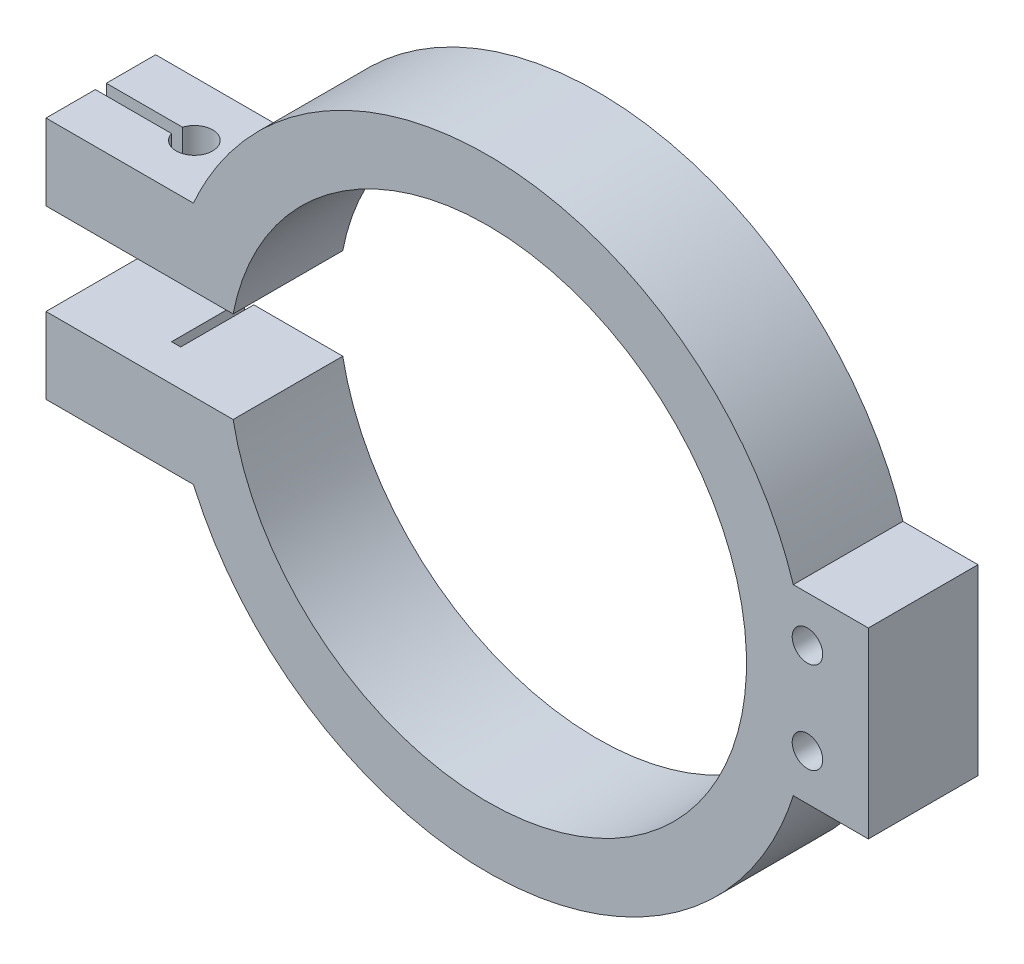
ISO-10303-21;
HEADER;
FILE_DESCRIPTION(('STEP AP214'),'2;1');
FILE_NAME('part.step','',(''),(''),'','','');
FILE_SCHEMA(('AUTOMOTIVE_DESIGN { 1 0 10303 214 1 1 1 1 }'));
ENDSEC;
DATA;
#1=APPLICATION_CONTEXT('core data for automotive mechanical design processes');
#2=APPLICATION_PROTOCOL_DEFINITION('international standard','automotive_design',2000,#1);
#3=PRODUCT_CONTEXT('',#1,'mechanical');
#4=PRODUCT('Part','Part','',(#3));
#5=PRODUCT_RELATED_PRODUCT_CATEGORY('part','',(#4));
#6=PRODUCT_DEFINITION_FORMATION('','',#4);
#7=PRODUCT_DEFINITION_CONTEXT('part definition',#1,'design');
#8=PRODUCT_DEFINITION('design','',#6,#7);
#9=PRODUCT_DEFINITION_SHAPE('','',#8);
#10=(LENGTH_UNIT() NAMED_UNIT(*) SI_UNIT(.MILLI.,.METRE.));
#11=(NAMED_UNIT(*) PLANE_ANGLE_UNIT() SI_UNIT($,.RADIAN.));
#12=(NAMED_UNIT(*) SI_UNIT($,.STERADIAN.) SOLID_ANGLE_UNIT());
#13=UNCERTAINTY_MEASURE_WITH_UNIT(LENGTH_MEASURE(1.E-05),#10,'distance_accuracy_value','');
#14=(GEOMETRIC_REPRESENTATION_CONTEXT(3) GLOBAL_UNCERTAINTY_ASSIGNED_CONTEXT((#13)) GLOBAL_UNIT_ASSIGNED_CONTEXT((#10,
#11,#12)) REPRESENTATION_CONTEXT('',''));
#15=CARTESIAN_POINT('',(0.,0.,0.));
#16=DIRECTION('',(0.,0.,1.));
#17=DIRECTION('',(1.,0.,0.));
#18=AXIS2_PLACEMENT_3D('',#15,#16,#17);
#19=CARTESIAN_POINT('',(-72.5,0.,18.));
#20=DIRECTION('',(1.,0.,0.));
#21=DIRECTION('',(0.,0.,-1.));
#22=AXIS2_PLACEMENT_3D('',#19,#20,#21);
#23=PLANE('',#22);
#24=DIRECTION('',(0.,0.,-1.));
#25=VECTOR('',#24,1.);
#26=CARTESIAN_POINT('',(-72.5,7.5,18.));
#27=LINE('',#26,#25);
#28=CARTESIAN_POINT('',(-72.5,7.5,8.1));
#29=VERTEX_POINT('',#28);
#30=CARTESIAN_POINT('',(-72.5,7.5,0.));
#31=VERTEX_POINT('',#30);
#32=EDGE_CURVE('E351',#29,#31,#27,.T.);
#33=ORIENTED_EDGE('',*,*,#32,.F.);
#34=DIRECTION('',(0.,1.,0.));
#35=VECTOR('',#34,1.);
#36=CARTESIAN_POINT('',(-72.5,14.,8.1));
#37=LINE('',#36,#35);
#38=CARTESIAN_POINT('',(-72.5,20.,8.1));
#39=VERTEX_POINT('',#38);
#40=EDGE_CURVE('E247',#29,#39,#37,.T.);
#41=ORIENTED_EDGE('',*,*,#40,.T.);
#42=DIRECTION('',(0.,0.,-1.));
#43=VECTOR('',#42,1.);
#44=CARTESIAN_POINT('',(-72.5,20.,18.));
#45=LINE('',#44,#43);
#46=CARTESIAN_POINT('',(-72.5,20.,0.));
#47=VERTEX_POINT('',#46);
#48=EDGE_CURVE('E349',#39,#47,#45,.T.);
#49=ORIENTED_EDGE('',*,*,#48,.T.);
#50=DIRECTION('',(0.,-1.,0.));
#51=VECTOR('',#50,1.);
#52=CARTESIAN_POINT('',(-72.5,0.,0.));
#53=LINE('',#52,#51);
#54=EDGE_CURVE('E404',#47,#31,#53,.T.);
#55=ORIENTED_EDGE('',*,*,#54,.T.);
#56=EDGE_LOOP('',(#33,#41,#49,#55));
#57=FACE_BOUND('',#56,.T.);
#58=ADVANCED_FACE('F54',(#57),#23,.F.);
#59=CARTESIAN_POINT('',(0.,7.5,18.));
#60=DIRECTION('',(0.,-1.,0.));
#61=DIRECTION('',(0.,0.,-1.));
#62=AXIS2_PLACEMENT_3D('',#59,#60,#61);
#63=PLANE('',#62);
#64=CARTESIAN_POINT('',(-57.1414387748637,7.5,9.));
#65=DIRECTION('',(0.,-1.,0.));
#66=DIRECTION('',(0.,0.,-1.));
#67=AXIS2_PLACEMENT_3D('',#64,#65,#66);
#68=CIRCLE('',#67,0.999999999999998);
#69=CARTESIAN_POINT('',(-57.5773286692178,7.5,9.9));
#70=VERTEX_POINT('',#69);
#71=CARTESIAN_POINT('',(-57.5773286692178,7.5,8.1));
#72=VERTEX_POINT('',#71);
#73=EDGE_CURVE('E214',#70,#72,#68,.F.);
#74=ORIENTED_EDGE('',*,*,#73,.T.);
#75=DIRECTION('',(1.,0.,0.));
#76=VECTOR('',#75,1.);
#77=CARTESIAN_POINT('',(0.,7.5,8.09999999999997));
#78=LINE('',#77,#76);
#79=EDGE_CURVE('E211',#29,#72,#78,.T.);
#80=ORIENTED_EDGE('',*,*,#79,.F.);
#81=ORIENTED_EDGE('',*,*,#32,.T.);
#82=DIRECTION('',(-1.,0.,0.));
#83=VECTOR('',#82,1.);
#84=CARTESIAN_POINT('',(0.,7.5,0.));
#85=LINE('',#84,#83);
#86=CARTESIAN_POINT('',(-41.7828775497274,7.5,0.));
#87=VERTEX_POINT('',#86);
#88=EDGE_CURVE('E401',#87,#31,#85,.T.);
#89=ORIENTED_EDGE('',*,*,#88,.F.);
#90=DIRECTION('',(0.,0.,-1.));
#91=VECTOR('',#90,1.);
#92=CARTESIAN_POINT('',(-41.7828775497274,7.5,18.));
#93=LINE('',#92,#91);
#94=CARTESIAN_POINT('',(-41.7828775497274,7.5,18.));
#95=VERTEX_POINT('',#94);
#96=EDGE_CURVE('E352',#95,#87,#93,.T.);
#97=ORIENTED_EDGE('',*,*,#96,.F.);
#98=DIRECTION('',(-1.,0.,0.));
#99=VECTOR('',#98,1.);
#100=CARTESIAN_POINT('',(0.,7.5,18.));
#101=LINE('',#100,#99);
#102=CARTESIAN_POINT('',(-72.5,7.5,18.));
#103=VERTEX_POINT('',#102);
#104=EDGE_CURVE('E466',#95,#103,#101,.T.);
#105=ORIENTED_EDGE('',*,*,#104,.T.);
#106=CARTESIAN_POINT('',(-72.5,7.5,9.9));
#107=VERTEX_POINT('',#106);
#108=EDGE_CURVE('E225',#103,#107,#27,.T.);
#109=ORIENTED_EDGE('',*,*,#108,.T.);
#110=DIRECTION('',(1.,0.,0.));
#111=VECTOR('',#110,1.);
#112=CARTESIAN_POINT('',(0.,7.5,9.9));
#113=LINE('',#112,#111);
#114=EDGE_CURVE('E207',#107,#70,#113,.T.);
#115=ORIENTED_EDGE('',*,*,#114,.T.);
#116=EDGE_LOOP('',(#74,#80,#81,#89,#97,#105,#109,#115));
#117=FACE_BOUND('',#116,.T.);
#118=ADVANCED_FACE('F222',(#117),#63,.T.);
#119=CARTESIAN_POINT('',(0.,14.,0.));
#120=DIRECTION('',(0.,1.,0.));
#121=DIRECTION('',(-1.,0.,0.));
#122=AXIS2_PLACEMENT_3D('',#119,#120,#121);
#123=PLANE('',#122);
#124=CARTESIAN_POINT('',(-57.1414387748637,14.,9.));
#125=DIRECTION('',(0.,1.,0.));
#126=DIRECTION('',(-1.,0.,0.));
#127=AXIS2_PLACEMENT_3D('',#124,#125,#126);
#128=CIRCLE('',#127,3.);
#129=CARTESIAN_POINT('',(-60.0032563791145,14.,9.9));
#130=VERTEX_POINT('',#129);
#131=CARTESIAN_POINT('',(-60.0032563791145,14.,8.1));
#132=VERTEX_POINT('',#131);
#133=EDGE_CURVE('E231',#130,#132,#128,.T.);
#134=ORIENTED_EDGE('',*,*,#133,.T.);
#135=DIRECTION('',(1.,0.,0.));
#136=VECTOR('',#135,1.);
#137=CARTESIAN_POINT('',(0.,14.,8.09999999999997));
#138=LINE('',#137,#136);
#139=CARTESIAN_POINT('',(-57.5773286692178,14.,8.1));
#140=VERTEX_POINT('',#139);
#141=EDGE_CURVE('E12',#132,#140,#138,.T.);
#142=ORIENTED_EDGE('',*,*,#141,.T.);
#143=CARTESIAN_POINT('',(-57.1414387748637,14.,9.));
#144=DIRECTION('',(0.,1.,0.));
#145=DIRECTION('',(-1.,0.,0.));
#146=AXIS2_PLACEMENT_3D('',#143,#144,#145);
#147=CIRCLE('',#146,0.999999999999998);
#148=CARTESIAN_POINT('',(-57.5773286692178,14.,9.9));
#149=VERTEX_POINT('',#148);
#150=EDGE_CURVE('E220',#149,#140,#147,.T.);
#151=ORIENTED_EDGE('',*,*,#150,.F.);
#152=DIRECTION('',(1.,0.,0.));
#153=VECTOR('',#152,1.);
#154=CARTESIAN_POINT('',(0.,14.,9.9));
#155=LINE('',#154,#153);
#156=EDGE_CURVE('E62',#130,#149,#155,.T.);
#157=ORIENTED_EDGE('',*,*,#156,.F.);
#158=EDGE_LOOP('',(#134,#142,#151,#157));
#159=FACE_BOUND('',#158,.T.);
#160=ADVANCED_FACE('F305',(#159),#123,.T.);
#161=CARTESIAN_POINT('',(0.,15.,18.));
#162=DIRECTION('',(0.,1.,0.));
#163=DIRECTION('',(0.,0.,1.));
#164=AXIS2_PLACEMENT_3D('',#161,#162,#163);
#165=PLANE('',#164);
#166=DIRECTION('',(1.,0.,0.));
#167=VECTOR('',#166,1.);
#168=CARTESIAN_POINT('',(0.,15.,0.));
#169=LINE('',#168,#167);
#170=CARTESIAN_POINT('',(50.1759270577626,15.,0.));
#171=VERTEX_POINT('',#170);
#172=CARTESIAN_POINT('',(62.5,15.,0.));
#173=VERTEX_POINT('',#172);
#174=EDGE_CURVE('E415',#171,#173,#169,.T.);
#175=ORIENTED_EDGE('',*,*,#174,.F.);
#176=DIRECTION('',(0.,0.,-1.));
#177=VECTOR('',#176,1.);
#178=CARTESIAN_POINT('',(50.1759270577626,15.,18.));
#179=LINE('',#178,#177);
#180=CARTESIAN_POINT('',(50.1759270577626,15.,18.));
#181=VERTEX_POINT('',#180);
#182=EDGE_CURVE('E342',#181,#171,#179,.T.);
#183=ORIENTED_EDGE('',*,*,#182,.F.);
#184=DIRECTION('',(1.,0.,0.));
#185=VECTOR('',#184,1.);
#186=CARTESIAN_POINT('',(0.,15.,18.));
#187=LINE('',#186,#185);
#188=CARTESIAN_POINT('',(62.5,15.,18.));
#189=VERTEX_POINT('',#188);
#190=EDGE_CURVE('E281',#181,#189,#187,.T.);
#191=ORIENTED_EDGE('',*,*,#190,.T.);
#192=DIRECTION('',(0.,0.,-1.));
#193=VECTOR('',#192,1.);
#194=CARTESIAN_POINT('',(62.5,15.,18.));
#195=LINE('',#194,#193);
#196=EDGE_CURVE('E369',#189,#173,#195,.T.);
#197=ORIENTED_EDGE('',*,*,#196,.T.);
#198=EDGE_LOOP('',(#175,#183,#191,#197));
#199=FACE_BOUND('',#198,.T.);
#200=ADVANCED_FACE('F301',(#199),#165,.T.);
#201=CARTESIAN_POINT('',(-52.5,0.,18.));
#202=CARTESIAN_POINT('',(-52.5,-6.72231623622186,18.));
#203=CARTESIAN_POINT('',(-49.7226864105581,-20.1669487086656,18.));
#204=CARTESIAN_POINT('',(-37.9426722717445,-37.1445713888762,18.));
#205=CARTESIAN_POINT('',(-20.4763884894602,-48.3846248427967,18.));
#206=CARTESIAN_POINT('',(0.,-52.3076875786016,18.));
#207=CARTESIAN_POINT('',(20.4763884894601,-48.3846248427967,18.));
#208=CARTESIAN_POINT('',(37.9426722717445,-37.1445713888762,18.));
#209=CARTESIAN_POINT('',(49.7226864105582,-20.1669487086656,18.));
#210=CARTESIAN_POINT('',(53.8886567947209,0.,18.));
#211=CARTESIAN_POINT('',(49.7226864105581,20.1669487086656,18.));
#212=CARTESIAN_POINT('',(37.9426722717445,37.1445713888762,18.));
#213=CARTESIAN_POINT('',(20.4763884894602,48.3846248427967,18.));
#214=CARTESIAN_POINT('',(0.,52.3076875786016,18.));
#215=CARTESIAN_POINT('',(-20.4763884894601,48.3846248427967,18.));
#216=CARTESIAN_POINT('',(-37.9426722717445,37.1445713888762,18.));
#217=CARTESIAN_POINT('',(-49.7226864105581,20.1669487086656,18.));
#218=CARTESIAN_POINT('',(-52.5,6.72231623622187,18.));
#219=CARTESIAN_POINT('',(-52.5,0.,18.));
#220=B_SPLINE_CURVE_WITH_KNOTS('',3,(#201,#202,#203,#204,#205,#206,#207,#208,#209,#210,#211,
#212,#213,#214,#215,#216,#217,#218,#219),.UNSPECIFIED.,.T.,.F.,(4,1,1,1,1,1,1,1,1,1,1,1,1,1,1,1,
4),(0.,0.392699081698724,0.785398163397448,1.17809724509617,1.5707963267949,1.96349540849362,
2.35619449019234,2.74889357189107,3.14159265358979,3.53429173528852,3.92699081698724,
4.31968989868597,4.71238898038469,5.10508806208341,5.49778714378214,5.89048622548086,
6.28318530717959),.UNSPECIFIED.);
#221=DIRECTION('',(0.,0.,-1.));
#222=VECTOR('',#221,1.);
#223=SURFACE_OF_LINEAR_EXTRUSION('',#220,#222);
#224=CARTESIAN_POINT('',(-52.5,0.,0.));
#225=CARTESIAN_POINT('',(-52.5,-6.72231623622186,0.));
#226=CARTESIAN_POINT('',(-49.7226864105581,-20.1669487086656,0.));
#227=CARTESIAN_POINT('',(-37.9426722717445,-37.1445713888762,0.));
#228=CARTESIAN_POINT('',(-20.4763884894602,-48.3846248427967,0.));
#229=CARTESIAN_POINT('',(0.,-52.3076875786016,0.));
#230=CARTESIAN_POINT('',(20.4763884894601,-48.3846248427967,0.));
#231=CARTESIAN_POINT('',(37.9426722717445,-37.1445713888762,0.));
#232=CARTESIAN_POINT('',(49.7226864105582,-20.1669487086656,0.));
#233=CARTESIAN_POINT('',(53.8886567947209,0.,0.));
#234=CARTESIAN_POINT('',(49.7226864105581,20.1669487086656,0.));
#235=CARTESIAN_POINT('',(37.9426722717445,37.1445713888762,0.));
#236=CARTESIAN_POINT('',(20.4763884894602,48.3846248427967,0.));
#237=CARTESIAN_POINT('',(0.,52.3076875786016,0.));
#238=CARTESIAN_POINT('',(-20.4763884894601,48.3846248427967,0.));
#239=CARTESIAN_POINT('',(-37.9426722717445,37.1445713888762,0.));
#240=CARTESIAN_POINT('',(-49.7226864105581,20.1669487086656,0.));
#241=CARTESIAN_POINT('',(-52.5,6.72231623622187,0.));
#242=CARTESIAN_POINT('',(-52.5,0.,0.));
#243=B_SPLINE_CURVE_WITH_KNOTS('',3,(#224,#225,#226,#227,#228,#229,#230,#231,#232,#233,#234,
#235,#236,#237,#238,#239,#240,#241,#242),.UNSPECIFIED.,.T.,.F.,(4,1,1,1,1,1,1,1,1,1,1,1,1,1,1,1,
4),(0.,0.392699081698724,0.785398163397448,1.17809724509617,1.5707963267949,1.96349540849362,
2.35619449019234,2.74889357189107,3.14159265358979,3.53429173528852,3.92699081698724,
4.31968989868597,4.71238898038469,5.10508806208341,5.49778714378214,5.89048622548086,
6.28318530717959),.UNSPECIFIED.);
#244=CARTESIAN_POINT('',(-48.2954197646971,20.,0.));
#245=VERTEX_POINT('',#244);
#246=EDGE_CURVE('E410',#171,#245,#243,.T.);
#247=ORIENTED_EDGE('',*,*,#246,.T.);
#248=DIRECTION('',(0.,0.,-1.));
#249=VECTOR('',#248,1.);
#250=CARTESIAN_POINT('',(-48.2954197646971,20.,18.));
#251=LINE('',#250,#249);
#252=CARTESIAN_POINT('',(-48.2954197646971,20.,18.));
#253=VERTEX_POINT('',#252);
#254=EDGE_CURVE('E343',#253,#245,#251,.T.);
#255=ORIENTED_EDGE('',*,*,#254,.F.);
#256=EDGE_CURVE('E285',#181,#253,#220,.T.);
#257=ORIENTED_EDGE('',*,*,#256,.F.);
#258=ORIENTED_EDGE('',*,*,#182,.T.);
#259=EDGE_LOOP('',(#247,#255,#257,#258));
#260=FACE_BOUND('',#259,.T.);
#261=ADVANCED_FACE('F297',(#260),#223,.F.);
#262=CARTESIAN_POINT('',(0.,20.,18.));
#263=DIRECTION('',(0.,-1.,0.));
#264=DIRECTION('',(1.,0.,0.));
#265=AXIS2_PLACEMENT_3D('',#262,#263,#264);
#266=PLANE('',#265);
#267=CARTESIAN_POINT('',(-57.1414387748637,20.,9.));
#268=DIRECTION('',(0.,1.,0.));
#269=DIRECTION('',(-1.,0.,0.));
#270=AXIS2_PLACEMENT_3D('',#267,#268,#269);
#271=CIRCLE('',#270,3.);
#272=CARTESIAN_POINT('',(-60.0032563791145,20.,9.9));
#273=VERTEX_POINT('',#272);
#274=CARTESIAN_POINT('',(-60.0032563791145,20.,8.1));
#275=VERTEX_POINT('',#274);
#276=EDGE_CURVE('E236',#273,#275,#271,.T.);
#277=ORIENTED_EDGE('',*,*,#276,.F.);
#278=DIRECTION('',(1.,0.,0.));
#279=VECTOR('',#278,1.);
#280=CARTESIAN_POINT('',(0.,20.,9.9));
#281=LINE('',#280,#279);
#282=CARTESIAN_POINT('',(-72.5,20.,9.9));
#283=VERTEX_POINT('',#282);
#284=EDGE_CURVE('E235',#283,#273,#281,.T.);
#285=ORIENTED_EDGE('',*,*,#284,.F.);
#286=CARTESIAN_POINT('',(-72.5,20.,18.));
#287=VERTEX_POINT('',#286);
#288=EDGE_CURVE('E334',#287,#283,#45,.T.);
#289=ORIENTED_EDGE('',*,*,#288,.F.);
#290=DIRECTION('',(-1.,0.,0.));
#291=VECTOR('',#290,1.);
#292=CARTESIAN_POINT('',(0.,20.,18.));
#293=LINE('',#292,#291);
#294=EDGE_CURVE('E291',#253,#287,#293,.T.);
#295=ORIENTED_EDGE('',*,*,#294,.F.);
#296=ORIENTED_EDGE('',*,*,#254,.T.);
#297=DIRECTION('',(-1.,0.,0.));
#298=VECTOR('',#297,1.);
#299=CARTESIAN_POINT('',(0.,20.,0.));
#300=LINE('',#299,#298);
#301=EDGE_CURVE('E407',#245,#47,#300,.T.);
#302=ORIENTED_EDGE('',*,*,#301,.T.);
#303=ORIENTED_EDGE('',*,*,#48,.F.);
#304=DIRECTION('',(1.,0.,0.));
#305=VECTOR('',#304,1.);
#306=CARTESIAN_POINT('',(0.,20.,8.1));
#307=LINE('',#306,#305);
#308=EDGE_CURVE('E239',#39,#275,#307,.T.);
#309=ORIENTED_EDGE('',*,*,#308,.T.);
#310=EDGE_LOOP('',(#277,#285,#289,#295,#296,#302,#303,#309));
#311=FACE_BOUND('',#310,.T.);
#312=ADVANCED_FACE('F300',(#311),#266,.F.);
#313=DIRECTION('',(0.,1.,0.));
#314=VECTOR('',#313,1.);
#315=CARTESIAN_POINT('',(-72.5,14.,9.9));
#316=LINE('',#315,#314);
#317=EDGE_CURVE('E245',#107,#283,#316,.T.);
#318=ORIENTED_EDGE('',*,*,#317,.F.);
#319=ORIENTED_EDGE('',*,*,#108,.F.);
#320=DIRECTION('',(0.,-1.,0.));
#321=VECTOR('',#320,1.);
#322=CARTESIAN_POINT('',(-72.5,0.,18.));
#323=LINE('',#322,#321);
#324=EDGE_CURVE('E489',#287,#103,#323,.T.);
#325=ORIENTED_EDGE('',*,*,#324,.F.);
#326=ORIENTED_EDGE('',*,*,#288,.T.);
#327=EDGE_LOOP('',(#318,#319,#325,#326));
#328=FACE_BOUND('',#327,.T.);
#329=ADVANCED_FACE('F315',(#328),#23,.F.);
#330=CARTESIAN_POINT('',(0.,0.,18.));
#331=DIRECTION('',(0.,0.,1.));
#332=DIRECTION('',(-1.,0.,0.));
#333=AXIS2_PLACEMENT_3D('',#330,#331,#332);
#334=ELLIPSE('',#333,42.5,41.);
#335=DIRECTION('',(0.,0.,-1.));
#336=VECTOR('',#335,1.);
#337=SURFACE_OF_LINEAR_EXTRUSION('',#334,#336);
#338=CARTESIAN_POINT('',(0.,0.,0.));
#339=DIRECTION('',(0.,0.,1.));
#340=DIRECTION('',(-1.,0.,0.));
#341=AXIS2_PLACEMENT_3D('',#338,#339,#340);
#342=ELLIPSE('',#341,42.5,41.);
#343=CARTESIAN_POINT('',(-41.7828775497274,-7.5,0.));
#344=VERTEX_POINT('',#343);
#345=EDGE_CURVE('E398',#344,#87,#342,.T.);
#346=ORIENTED_EDGE('',*,*,#345,.F.);
#347=DIRECTION('',(0.,0.,-1.));
#348=VECTOR('',#347,1.);
#349=CARTESIAN_POINT('',(-41.7828775497274,-7.5,18.));
#350=LINE('',#349,#348);
#351=CARTESIAN_POINT('',(-41.7828775497274,-7.5,18.));
#352=VERTEX_POINT('',#351);
#353=EDGE_CURVE('E354',#352,#344,#350,.T.);
#354=ORIENTED_EDGE('',*,*,#353,.F.);
#355=EDGE_CURVE('E460',#352,#95,#334,.T.);
#356=ORIENTED_EDGE('',*,*,#355,.T.);
#357=ORIENTED_EDGE('',*,*,#96,.T.);
#358=EDGE_LOOP('',(#346,#354,#356,#357));
#359=FACE_BOUND('',#358,.T.);
#360=ADVANCED_FACE('F322',(#359),#337,.T.);
#361=CARTESIAN_POINT('',(0.,-7.5,18.));
#362=DIRECTION('',(0.,-1.,0.));
#363=DIRECTION('',(0.,0.,-1.));
#364=AXIS2_PLACEMENT_3D('',#361,#362,#363);
#365=PLANE('',#364);
#366=DIRECTION('',(-1.,0.,0.));
#367=VECTOR('',#366,1.);
#368=CARTESIAN_POINT('',(0.,-7.5,0.));
#369=LINE('',#368,#367);
#370=CARTESIAN_POINT('',(-56.3914387748637,-7.5,0.));
#371=VERTEX_POINT('',#370);
#372=EDGE_CURVE('E394',#344,#371,#369,.T.);
#373=ORIENTED_EDGE('',*,*,#372,.T.);
#374=DIRECTION('',(0.,0.,-1.));
#375=VECTOR('',#374,1.);
#376=CARTESIAN_POINT('',(-56.3914387748637,-7.5,12.));
#377=LINE('',#376,#375);
#378=CARTESIAN_POINT('',(-56.3914387748637,-7.5,12.));
#379=VERTEX_POINT('',#378);
#380=EDGE_CURVE('E272',#379,#371,#377,.T.);
#381=ORIENTED_EDGE('',*,*,#380,.F.);
#382=DIRECTION('',(1.,0.,0.));
#383=VECTOR('',#382,1.);
#384=CARTESIAN_POINT('',(0.,-7.5,12.));
#385=LINE('',#384,#383);
#386=CARTESIAN_POINT('',(-57.8914387748637,-7.5,12.));
#387=VERTEX_POINT('',#386);
#388=EDGE_CURVE('E257',#387,#379,#385,.T.);
#389=ORIENTED_EDGE('',*,*,#388,.F.);
#390=DIRECTION('',(0.,0.,-1.));
#391=VECTOR('',#390,1.);
#392=CARTESIAN_POINT('',(-57.8914387748637,-7.5,12.));
#393=LINE('',#392,#391);
#394=CARTESIAN_POINT('',(-57.8914387748637,-7.5,0.));
#395=VERTEX_POINT('',#394);
#396=EDGE_CURVE('E274',#387,#395,#393,.T.);
#397=ORIENTED_EDGE('',*,*,#396,.T.);
#398=CARTESIAN_POINT('',(-72.5,-7.5,0.));
#399=VERTEX_POINT('',#398);
#400=EDGE_CURVE('E397',#395,#399,#369,.T.);
#401=ORIENTED_EDGE('',*,*,#400,.T.);
#402=DIRECTION('',(0.,0.,-1.));
#403=VECTOR('',#402,1.);
#404=CARTESIAN_POINT('',(-72.5,-7.5,18.));
#405=LINE('',#404,#403);
#406=CARTESIAN_POINT('',(-72.5,-7.5,18.));
#407=VERTEX_POINT('',#406);
#408=EDGE_CURVE('E356',#407,#399,#405,.T.);
#409=ORIENTED_EDGE('',*,*,#408,.F.);
#410=DIRECTION('',(-1.,0.,0.));
#411=VECTOR('',#410,1.);
#412=CARTESIAN_POINT('',(0.,-7.5,18.));
#413=LINE('',#412,#411);
#414=EDGE_CURVE('E465',#352,#407,#413,.T.);
#415=ORIENTED_EDGE('',*,*,#414,.F.);
#416=ORIENTED_EDGE('',*,*,#353,.T.);
#417=EDGE_LOOP('',(#373,#381,#389,#397,#401,#409,#415,#416));
#418=FACE_BOUND('',#417,.T.);
#419=ADVANCED_FACE('F328',(#418),#365,.F.);
#420=CARTESIAN_POINT('',(-72.5,0.,18.));
#421=DIRECTION('',(1.,0.,0.));
#422=DIRECTION('',(0.,0.,-1.));
#423=AXIS2_PLACEMENT_3D('',#420,#421,#422);
#424=PLANE('',#423);
#425=DIRECTION('',(0.,-1.,0.));
#426=VECTOR('',#425,1.);
#427=CARTESIAN_POINT('',(-72.5,0.,0.));
#428=LINE('',#427,#426);
#429=CARTESIAN_POINT('',(-72.5,-20.,0.));
#430=VERTEX_POINT('',#429);
#431=EDGE_CURVE('E391',#399,#430,#428,.T.);
#432=ORIENTED_EDGE('',*,*,#431,.T.);
#433=DIRECTION('',(0.,0.,-1.));
#434=VECTOR('',#433,1.);
#435=CARTESIAN_POINT('',(-72.5,-20.,18.));
#436=LINE('',#435,#434);
#437=CARTESIAN_POINT('',(-72.5,-20.,18.));
#438=VERTEX_POINT('',#437);
#439=EDGE_CURVE('E359',#438,#430,#436,.T.);
#440=ORIENTED_EDGE('',*,*,#439,.F.);
#441=DIRECTION('',(0.,-1.,0.));
#442=VECTOR('',#441,1.);
#443=CARTESIAN_POINT('',(-72.5,0.,18.));
#444=LINE('',#443,#442);
#445=EDGE_CURVE('E468',#407,#438,#444,.T.);
#446=ORIENTED_EDGE('',*,*,#445,.F.);
#447=ORIENTED_EDGE('',*,*,#408,.T.);
#448=EDGE_LOOP('',(#432,#440,#446,#447));
#449=FACE_BOUND('',#448,.T.);
#450=ADVANCED_FACE('F452',(#449),#424,.F.);
#451=CARTESIAN_POINT('',(0.,-20.,18.));
#452=DIRECTION('',(0.,-1.,0.));
#453=DIRECTION('',(1.,0.,0.));
#454=AXIS2_PLACEMENT_3D('',#451,#452,#453);
#455=PLANE('',#454);
#456=DIRECTION('',(-1.,0.,0.));
#457=VECTOR('',#456,1.);
#458=CARTESIAN_POINT('',(0.,-20.,0.));
#459=LINE('',#458,#457);
#460=CARTESIAN_POINT('',(-48.295419764697,-20.,0.));
#461=VERTEX_POINT('',#460);
#462=EDGE_CURVE('E385',#461,#430,#459,.T.);
#463=ORIENTED_EDGE('',*,*,#462,.F.);
#464=DIRECTION('',(0.,0.,-1.));
#465=VECTOR('',#464,1.);
#466=CARTESIAN_POINT('',(-48.295419764697,-20.,18.));
#467=LINE('',#466,#465);
#468=CARTESIAN_POINT('',(-48.295419764697,-20.,18.));
#469=VERTEX_POINT('',#468);
#470=EDGE_CURVE('E361',#469,#461,#467,.T.);
#471=ORIENTED_EDGE('',*,*,#470,.F.);
#472=DIRECTION('',(-1.,0.,0.));
#473=VECTOR('',#472,1.);
#474=CARTESIAN_POINT('',(0.,-20.,18.));
#475=LINE('',#474,#473);
#476=EDGE_CURVE('E436',#469,#438,#475,.T.);
#477=ORIENTED_EDGE('',*,*,#476,.T.);
#478=ORIENTED_EDGE('',*,*,#439,.T.);
#479=EDGE_LOOP('',(#463,#471,#477,#478));
#480=FACE_BOUND('',#479,.T.);
#481=ADVANCED_FACE('F447',(#480),#455,.T.);
#482=CARTESIAN_POINT('',(-52.5,0.,18.));
#483=CARTESIAN_POINT('',(-52.5,-6.72231623622186,18.));
#484=CARTESIAN_POINT('',(-49.7226864105581,-20.1669487086656,18.));
#485=CARTESIAN_POINT('',(-37.9426722717445,-37.1445713888762,18.));
#486=CARTESIAN_POINT('',(-20.4763884894602,-48.3846248427967,18.));
#487=CARTESIAN_POINT('',(0.,-52.3076875786016,18.));
#488=CARTESIAN_POINT('',(20.4763884894601,-48.3846248427967,18.));
#489=CARTESIAN_POINT('',(37.9426722717445,-37.1445713888762,18.));
#490=CARTESIAN_POINT('',(49.7226864105582,-20.1669487086656,18.));
#491=CARTESIAN_POINT('',(53.8886567947209,0.,18.));
#492=CARTESIAN_POINT('',(49.7226864105581,20.1669487086656,18.));
#493=CARTESIAN_POINT('',(37.9426722717445,37.1445713888762,18.));
#494=CARTESIAN_POINT('',(20.4763884894602,48.3846248427967,18.));
#495=CARTESIAN_POINT('',(0.,52.3076875786016,18.));
#496=CARTESIAN_POINT('',(-20.4763884894601,48.3846248427967,18.));
#497=CARTESIAN_POINT('',(-37.9426722717445,37.1445713888762,18.));
#498=CARTESIAN_POINT('',(-49.7226864105581,20.1669487086656,18.));
#499=CARTESIAN_POINT('',(-52.5,6.72231623622187,18.));
#500=CARTESIAN_POINT('',(-52.5,0.,18.));
#501=B_SPLINE_CURVE_WITH_KNOTS('',3,(#482,#483,#484,#485,#486,#487,#488,#489,#490,#491,#492,
#493,#494,#495,#496,#497,#498,#499,#500),.UNSPECIFIED.,.T.,.F.,(4,1,1,1,1,1,1,1,1,1,1,1,1,1,1,1,
4),(0.,0.392699081698724,0.785398163397448,1.17809724509617,1.5707963267949,1.96349540849362,
2.35619449019234,2.74889357189107,3.14159265358979,3.53429173528852,3.92699081698724,
4.31968989868597,4.71238898038469,5.10508806208341,5.49778714378214,5.89048622548086,
6.28318530717959),.UNSPECIFIED.);
#502=DIRECTION('',(0.,0.,-1.));
#503=VECTOR('',#502,1.);
#504=SURFACE_OF_LINEAR_EXTRUSION('',#501,#503);
#505=CARTESIAN_POINT('',(-52.5,0.,0.));
#506=CARTESIAN_POINT('',(-52.5,-6.72231623622186,0.));
#507=CARTESIAN_POINT('',(-49.7226864105581,-20.1669487086656,0.));
#508=CARTESIAN_POINT('',(-37.9426722717445,-37.1445713888762,0.));
#509=CARTESIAN_POINT('',(-20.4763884894602,-48.3846248427967,0.));
#510=CARTESIAN_POINT('',(0.,-52.3076875786016,0.));
#511=CARTESIAN_POINT('',(20.4763884894601,-48.3846248427967,0.));
#512=CARTESIAN_POINT('',(37.9426722717445,-37.1445713888762,0.));
#513=CARTESIAN_POINT('',(49.7226864105582,-20.1669487086656,0.));
#514=CARTESIAN_POINT('',(53.8886567947209,0.,0.));
#515=CARTESIAN_POINT('',(49.7226864105581,20.1669487086656,0.));
#516=CARTESIAN_POINT('',(37.9426722717445,37.1445713888762,0.));
#517=CARTESIAN_POINT('',(20.4763884894602,48.3846248427967,0.));
#518=CARTESIAN_POINT('',(0.,52.3076875786016,0.));
#519=CARTESIAN_POINT('',(-20.4763884894601,48.3846248427967,0.));
#520=CARTESIAN_POINT('',(-37.9426722717445,37.1445713888762,0.));
#521=CARTESIAN_POINT('',(-49.7226864105581,20.1669487086656,0.));
#522=CARTESIAN_POINT('',(-52.5,6.72231623622187,0.));
#523=CARTESIAN_POINT('',(-52.5,0.,0.));
#524=B_SPLINE_CURVE_WITH_KNOTS('',3,(#505,#506,#507,#508,#509,#510,#511,#512,#513,#514,#515,
#516,#517,#518,#519,#520,#521,#522,#523),.UNSPECIFIED.,.T.,.F.,(4,1,1,1,1,1,1,1,1,1,1,1,1,1,1,1,
4),(0.,0.392699081698724,0.785398163397448,1.17809724509617,1.5707963267949,1.96349540849362,
2.35619449019234,2.74889357189107,3.14159265358979,3.53429173528852,3.92699081698724,
4.31968989868597,4.71238898038469,5.10508806208341,5.49778714378214,5.89048622548086,
6.28318530717959),.UNSPECIFIED.);
#525=CARTESIAN_POINT('',(50.1759270577626,-15.,0.));
#526=VERTEX_POINT('',#525);
#527=EDGE_CURVE('E380',#461,#526,#524,.T.);
#528=ORIENTED_EDGE('',*,*,#527,.T.);
#529=DIRECTION('',(0.,0.,-1.));
#530=VECTOR('',#529,1.);
#531=CARTESIAN_POINT('',(50.1759270577626,-15.,18.));
#532=LINE('',#531,#530);
#533=CARTESIAN_POINT('',(50.1759270577626,-15.,18.));
#534=VERTEX_POINT('',#533);
#535=EDGE_CURVE('E363',#534,#526,#532,.T.);
#536=ORIENTED_EDGE('',*,*,#535,.F.);
#537=EDGE_CURVE('E430',#469,#534,#501,.T.);
#538=ORIENTED_EDGE('',*,*,#537,.F.);
#539=ORIENTED_EDGE('',*,*,#470,.T.);
#540=EDGE_LOOP('',(#528,#536,#538,#539));
#541=FACE_BOUND('',#540,.T.);
#542=ADVANCED_FACE('F442',(#541),#504,.F.);
#543=CARTESIAN_POINT('',(0.,-15.,18.));
#544=DIRECTION('',(0.,1.,0.));
#545=DIRECTION('',(0.,0.,1.));
#546=AXIS2_PLACEMENT_3D('',#543,#544,#545);
#547=PLANE('',#546);
#548=DIRECTION('',(1.,0.,0.));
#549=VECTOR('',#548,1.);
#550=CARTESIAN_POINT('',(0.,-15.,0.));
#551=LINE('',#550,#549);
#552=CARTESIAN_POINT('',(62.5,-15.,0.));
#553=VERTEX_POINT('',#552);
#554=EDGE_CURVE('E377',#526,#553,#551,.T.);
#555=ORIENTED_EDGE('',*,*,#554,.T.);
#556=DIRECTION('',(0.,0.,-1.));
#557=VECTOR('',#556,1.);
#558=CARTESIAN_POINT('',(62.5,-15.,18.));
#559=LINE('',#558,#557);
#560=CARTESIAN_POINT('',(62.5,-15.,18.));
#561=VERTEX_POINT('',#560);
#562=EDGE_CURVE('E366',#561,#553,#559,.T.);
#563=ORIENTED_EDGE('',*,*,#562,.F.);
#564=DIRECTION('',(1.,0.,0.));
#565=VECTOR('',#564,1.);
#566=CARTESIAN_POINT('',(0.,-15.,18.));
#567=LINE('',#566,#565);
#568=EDGE_CURVE('E427',#534,#561,#567,.T.);
#569=ORIENTED_EDGE('',*,*,#568,.F.);
#570=ORIENTED_EDGE('',*,*,#535,.T.);
#571=EDGE_LOOP('',(#555,#563,#569,#570));
#572=FACE_BOUND('',#571,.T.);
#573=ADVANCED_FACE('F446',(#572),#547,.F.);
#574=CARTESIAN_POINT('',(62.5,0.,18.));
#575=DIRECTION('',(-1.,0.,0.));
#576=DIRECTION('',(0.,0.,1.));
#577=AXIS2_PLACEMENT_3D('',#574,#575,#576);
#578=PLANE('',#577);
#579=DIRECTION('',(0.,1.,0.));
#580=VECTOR('',#579,1.);
#581=CARTESIAN_POINT('',(62.5,0.,0.));
#582=LINE('',#581,#580);
#583=EDGE_CURVE('E374',#553,#173,#582,.T.);
#584=ORIENTED_EDGE('',*,*,#583,.T.);
#585=ORIENTED_EDGE('',*,*,#196,.F.);
#586=DIRECTION('',(0.,1.,0.));
#587=VECTOR('',#586,1.);
#588=CARTESIAN_POINT('',(62.5,0.,18.));
#589=LINE('',#588,#587);
#590=EDGE_CURVE('E425',#561,#189,#589,.T.);
#591=ORIENTED_EDGE('',*,*,#590,.F.);
#592=ORIENTED_EDGE('',*,*,#562,.T.);
#593=EDGE_LOOP('',(#584,#585,#591,#592));
#594=FACE_BOUND('',#593,.T.);
#595=ADVANCED_FACE('F483',(#594),#578,.F.);
#596=CARTESIAN_POINT('',(52.5,-7.5,18.));
#597=DIRECTION('',(0.,0.,-1.));
#598=DIRECTION('',(-1.,0.,0.));
#599=AXIS2_PLACEMENT_3D('',#596,#597,#598);
#600=CYLINDRICAL_SURFACE('',#599,2.5);
#601=CARTESIAN_POINT('',(52.5,-7.5,18.));
#602=DIRECTION('',(0.,0.,1.));
#603=DIRECTION('',(1.,0.,0.));
#604=AXIS2_PLACEMENT_3D('',#601,#602,#603);
#605=CIRCLE('',#604,2.5);
#606=CARTESIAN_POINT('',(55.,-7.5,18.));
#607=VERTEX_POINT('',#606);
#608=EDGE_CURVE('E278',#607,#607,#605,.T.);
#609=ORIENTED_EDGE('',*,*,#608,.T.);
#610=EDGE_LOOP('',(#609));
#611=FACE_BOUND('',#610,.T.);
#612=CARTESIAN_POINT('',(52.5,-7.5,0.));
#613=DIRECTION('',(0.,0.,1.));
#614=DIRECTION('',(1.,0.,0.));
#615=AXIS2_PLACEMENT_3D('',#612,#613,#614);
#616=CIRCLE('',#615,2.5);
#617=CARTESIAN_POINT('',(55.,-7.5,0.));
#618=VERTEX_POINT('',#617);
#619=EDGE_CURVE('E271',#618,#618,#616,.T.);
#620=ORIENTED_EDGE('',*,*,#619,.F.);
#621=EDGE_LOOP('',(#620));
#622=FACE_BOUND('',#621,.T.);
#623=ADVANCED_FACE('F56',(#611,#622),#600,.F.);
#624=CARTESIAN_POINT('',(52.5,7.5,18.));
#625=DIRECTION('',(0.,0.,-1.));
#626=DIRECTION('',(-1.,0.,0.));
#627=AXIS2_PLACEMENT_3D('',#624,#625,#626);
#628=CYLINDRICAL_SURFACE('',#627,2.5);
#629=CARTESIAN_POINT('',(52.5,7.5,18.));
#630=DIRECTION('',(0.,0.,1.));
#631=DIRECTION('',(1.,0.,0.));
#632=AXIS2_PLACEMENT_3D('',#629,#630,#631);
#633=CIRCLE('',#632,2.5);
#634=CARTESIAN_POINT('',(55.,7.5,18.));
#635=VERTEX_POINT('',#634);
#636=EDGE_CURVE('E371',#635,#635,#633,.T.);
#637=ORIENTED_EDGE('',*,*,#636,.T.);
#638=EDGE_LOOP('',(#637));
#639=FACE_BOUND('',#638,.T.);
#640=CARTESIAN_POINT('',(52.5,7.5,0.));
#641=DIRECTION('',(0.,0.,1.));
#642=DIRECTION('',(1.,0.,0.));
#643=AXIS2_PLACEMENT_3D('',#640,#641,#642);
#644=CIRCLE('',#643,2.5);
#645=CARTESIAN_POINT('',(55.,7.5,0.));
#646=VERTEX_POINT('',#645);
#647=EDGE_CURVE('E282',#646,#646,#644,.T.);
#648=ORIENTED_EDGE('',*,*,#647,.F.);
#649=EDGE_LOOP('',(#648));
#650=FACE_BOUND('',#649,.T.);
#651=ADVANCED_FACE('F530',(#639,#650),#628,.F.);
#652=CARTESIAN_POINT('',(0.,0.,18.));
#653=DIRECTION('',(0.,0.,1.));
#654=DIRECTION('',(1.,0.,0.));
#655=AXIS2_PLACEMENT_3D('',#652,#653,#654);
#656=PLANE('',#655);
#657=ORIENTED_EDGE('',*,*,#608,.F.);
#658=EDGE_LOOP('',(#657));
#659=FACE_BOUND('',#658,.T.);
#660=ORIENTED_EDGE('',*,*,#190,.F.);
#661=ORIENTED_EDGE('',*,*,#256,.T.);
#662=ORIENTED_EDGE('',*,*,#294,.T.);
#663=ORIENTED_EDGE('',*,*,#324,.T.);
#664=ORIENTED_EDGE('',*,*,#104,.F.);
#665=ORIENTED_EDGE('',*,*,#355,.F.);
#666=ORIENTED_EDGE('',*,*,#414,.T.);
#667=ORIENTED_EDGE('',*,*,#445,.T.);
#668=ORIENTED_EDGE('',*,*,#476,.F.);
#669=ORIENTED_EDGE('',*,*,#537,.T.);
#670=ORIENTED_EDGE('',*,*,#568,.T.);
#671=ORIENTED_EDGE('',*,*,#590,.T.);
#672=EDGE_LOOP('',(#660,#661,#662,#663,#664,#665,#666,#667,#668,#669,#670,#671));
#673=FACE_BOUND('',#672,.T.);
#674=ORIENTED_EDGE('',*,*,#636,.F.);
#675=EDGE_LOOP('',(#674));
#676=FACE_BOUND('',#675,.T.);
#677=ADVANCED_FACE('F476',(#659,#673,#676),#656,.T.);
#678=CARTESIAN_POINT('',(0.,0.,0.));
#679=DIRECTION('',(0.,0.,1.));
#680=DIRECTION('',(1.,0.,0.));
#681=AXIS2_PLACEMENT_3D('',#678,#679,#680);
#682=PLANE('',#681);
#683=ORIENTED_EDGE('',*,*,#619,.T.);
#684=EDGE_LOOP('',(#683));
#685=FACE_BOUND('',#684,.T.);
#686=CARTESIAN_POINT('',(-57.1414387748637,-13.75,0.));
#687=DIRECTION('',(0.,0.,-1.));
#688=DIRECTION('',(-1.,0.,0.));
#689=AXIS2_PLACEMENT_3D('',#686,#687,#688);
#690=CIRCLE('',#689,3.);
#691=CARTESIAN_POINT('',(-56.3914387748637,-10.8452624903444,0.));
#692=VERTEX_POINT('',#691);
#693=CARTESIAN_POINT('',(-57.8914387748637,-10.8452624903444,0.));
#694=VERTEX_POINT('',#693);
#695=EDGE_CURVE('E77',#692,#694,#690,.T.);
#696=ORIENTED_EDGE('',*,*,#695,.F.);
#697=DIRECTION('',(0.,-1.,0.));
#698=VECTOR('',#697,1.);
#699=CARTESIAN_POINT('',(-56.3914387748637,0.,0.));
#700=LINE('',#699,#698);
#701=EDGE_CURVE('E255',#371,#692,#700,.T.);
#702=ORIENTED_EDGE('',*,*,#701,.F.);
#703=ORIENTED_EDGE('',*,*,#372,.F.);
#704=ORIENTED_EDGE('',*,*,#345,.T.);
#705=ORIENTED_EDGE('',*,*,#88,.T.);
#706=ORIENTED_EDGE('',*,*,#54,.F.);
#707=ORIENTED_EDGE('',*,*,#301,.F.);
#708=ORIENTED_EDGE('',*,*,#246,.F.);
#709=ORIENTED_EDGE('',*,*,#174,.T.);
#710=ORIENTED_EDGE('',*,*,#583,.F.);
#711=ORIENTED_EDGE('',*,*,#554,.F.);
#712=ORIENTED_EDGE('',*,*,#527,.F.);
#713=ORIENTED_EDGE('',*,*,#462,.T.);
#714=ORIENTED_EDGE('',*,*,#431,.F.);
#715=ORIENTED_EDGE('',*,*,#400,.F.);
#716=DIRECTION('',(0.,-1.,0.));
#717=VECTOR('',#716,1.);
#718=CARTESIAN_POINT('',(-57.8914387748637,0.,0.));
#719=LINE('',#718,#717);
#720=EDGE_CURVE('E264',#395,#694,#719,.T.);
#721=ORIENTED_EDGE('',*,*,#720,.T.);
#722=EDGE_LOOP('',(#696,#702,#703,#704,#705,#706,#707,#708,#709,#710,#711,#712,#713,#714,#715,#721));
#723=FACE_BOUND('',#722,.T.);
#724=ORIENTED_EDGE('',*,*,#647,.T.);
#725=EDGE_LOOP('',(#724));
#726=FACE_BOUND('',#725,.T.);
#727=ADVANCED_FACE('F500',(#685,#723,#726),#682,.F.);
#728=CARTESIAN_POINT('',(-57.1414387748637,-13.75,12.));
#729=DIRECTION('',(0.,0.,-1.));
#730=DIRECTION('',(-1.,0.,0.));
#731=AXIS2_PLACEMENT_3D('',#728,#729,#730);
#732=CYLINDRICAL_SURFACE('',#731,3.);
#733=ORIENTED_EDGE('',*,*,#695,.T.);
#734=DIRECTION('',(0.,0.,-1.));
#735=VECTOR('',#734,1.);
#736=CARTESIAN_POINT('',(-57.8914387748637,-10.8452624903444,12.));
#737=LINE('',#736,#735);
#738=CARTESIAN_POINT('',(-57.8914387748637,-10.8452624903444,12.));
#739=VERTEX_POINT('',#738);
#740=EDGE_CURVE('E262',#739,#694,#737,.T.);
#741=ORIENTED_EDGE('',*,*,#740,.F.);
#742=CARTESIAN_POINT('',(-57.1414387748637,-13.75,12.));
#743=DIRECTION('',(0.,0.,-1.));
#744=DIRECTION('',(-1.,0.,0.));
#745=AXIS2_PLACEMENT_3D('',#742,#743,#744);
#746=CIRCLE('',#745,3.);
#747=CARTESIAN_POINT('',(-56.3914387748637,-10.8452624903444,12.));
#748=VERTEX_POINT('',#747);
#749=EDGE_CURVE('E251',#748,#739,#746,.T.);
#750=ORIENTED_EDGE('',*,*,#749,.F.);
#751=DIRECTION('',(0.,0.,-1.));
#752=VECTOR('',#751,1.);
#753=CARTESIAN_POINT('',(-56.3914387748637,-10.8452624903444,12.));
#754=LINE('',#753,#752);
#755=EDGE_CURVE('E269',#748,#692,#754,.T.);
#756=ORIENTED_EDGE('',*,*,#755,.T.);
#757=EDGE_LOOP('',(#733,#741,#750,#756));
#758=FACE_BOUND('',#757,.T.);
#759=ADVANCED_FACE('F517',(#758),#732,.F.);
#760=CARTESIAN_POINT('',(-56.3914387748637,0.,12.));
#761=DIRECTION('',(1.,0.,0.));
#762=DIRECTION('',(0.,0.,-1.));
#763=AXIS2_PLACEMENT_3D('',#760,#761,#762);
#764=PLANE('',#763);
#765=ORIENTED_EDGE('',*,*,#701,.T.);
#766=ORIENTED_EDGE('',*,*,#755,.F.);
#767=DIRECTION('',(0.,-1.,0.));
#768=VECTOR('',#767,1.);
#769=CARTESIAN_POINT('',(-56.3914387748637,0.,12.));
#770=LINE('',#769,#768);
#771=EDGE_CURVE('E259',#379,#748,#770,.T.);
#772=ORIENTED_EDGE('',*,*,#771,.F.);
#773=ORIENTED_EDGE('',*,*,#380,.T.);
#774=EDGE_LOOP('',(#765,#766,#772,#773));
#775=FACE_BOUND('',#774,.T.);
#776=ADVANCED_FACE('F510',(#775),#764,.F.);
#777=CARTESIAN_POINT('',(-57.8914387748637,0.,12.));
#778=DIRECTION('',(1.,0.,0.));
#779=DIRECTION('',(0.,0.,-1.));
#780=AXIS2_PLACEMENT_3D('',#777,#778,#779);
#781=PLANE('',#780);
#782=ORIENTED_EDGE('',*,*,#720,.F.);
#783=ORIENTED_EDGE('',*,*,#396,.F.);
#784=DIRECTION('',(0.,-1.,0.));
#785=VECTOR('',#784,1.);
#786=CARTESIAN_POINT('',(-57.8914387748637,0.,12.));
#787=LINE('',#786,#785);
#788=EDGE_CURVE('E254',#387,#739,#787,.T.);
#789=ORIENTED_EDGE('',*,*,#788,.T.);
#790=ORIENTED_EDGE('',*,*,#740,.T.);
#791=EDGE_LOOP('',(#782,#783,#789,#790));
#792=FACE_BOUND('',#791,.T.);
#793=ADVANCED_FACE('F516',(#792),#781,.T.);
#794=CARTESIAN_POINT('',(0.,0.,12.));
#795=DIRECTION('',(0.,0.,-1.));
#796=DIRECTION('',(-1.,0.,0.));
#797=AXIS2_PLACEMENT_3D('',#794,#795,#796);
#798=PLANE('',#797);
#799=ORIENTED_EDGE('',*,*,#749,.T.);
#800=ORIENTED_EDGE('',*,*,#788,.F.);
#801=ORIENTED_EDGE('',*,*,#388,.T.);
#802=ORIENTED_EDGE('',*,*,#771,.T.);
#803=EDGE_LOOP('',(#799,#800,#801,#802));
#804=FACE_BOUND('',#803,.T.);
#805=ADVANCED_FACE('F513',(#804),#798,.T.);
#806=CARTESIAN_POINT('',(-57.1414387748637,14.,9.));
#807=DIRECTION('',(0.,1.,0.));
#808=DIRECTION('',(-1.,0.,0.));
#809=AXIS2_PLACEMENT_3D('',#806,#807,#808);
#810=CYLINDRICAL_SURFACE('',#809,3.);
#811=ORIENTED_EDGE('',*,*,#276,.T.);
#812=DIRECTION('',(0.,1.,0.));
#813=VECTOR('',#812,1.);
#814=CARTESIAN_POINT('',(-60.0032563791145,14.,8.1));
#815=LINE('',#814,#813);
#816=EDGE_CURVE('E234',#132,#275,#815,.T.);
#817=ORIENTED_EDGE('',*,*,#816,.F.);
#818=ORIENTED_EDGE('',*,*,#133,.F.);
#819=DIRECTION('',(0.,1.,0.));
#820=VECTOR('',#819,1.);
#821=CARTESIAN_POINT('',(-60.0032563791145,14.,9.9));
#822=LINE('',#821,#820);
#823=EDGE_CURVE('E243',#130,#273,#822,.T.);
#824=ORIENTED_EDGE('',*,*,#823,.T.);
#825=EDGE_LOOP('',(#811,#817,#818,#824));
#826=FACE_BOUND('',#825,.T.);
#827=ADVANCED_FACE('F340',(#826),#810,.F.);
#828=CARTESIAN_POINT('',(0.,14.,9.9));
#829=DIRECTION('',(0.,0.,1.));
#830=DIRECTION('',(1.,0.,0.));
#831=AXIS2_PLACEMENT_3D('',#828,#829,#830);
#832=PLANE('',#831);
#833=ORIENTED_EDGE('',*,*,#284,.T.);
#834=ORIENTED_EDGE('',*,*,#823,.F.);
#835=ORIENTED_EDGE('',*,*,#156,.T.);
#836=DIRECTION('',(0.,1.,0.));
#837=VECTOR('',#836,1.);
#838=CARTESIAN_POINT('',(-57.5773286692178,-52.3086875786016,9.9));
#839=LINE('',#838,#837);
#840=EDGE_CURVE('E69',#70,#149,#839,.T.);
#841=ORIENTED_EDGE('',*,*,#840,.F.);
#842=ORIENTED_EDGE('',*,*,#114,.F.);
#843=ORIENTED_EDGE('',*,*,#317,.T.);
#844=EDGE_LOOP('',(#833,#834,#835,#841,#842,#843));
#845=FACE_BOUND('',#844,.T.);
#846=ADVANCED_FACE('F205',(#845),#832,.F.);
#847=CARTESIAN_POINT('',(0.,14.,8.1));
#848=DIRECTION('',(0.,0.,1.));
#849=DIRECTION('',(1.,0.,0.));
#850=AXIS2_PLACEMENT_3D('',#847,#848,#849);
#851=PLANE('',#850);
#852=ORIENTED_EDGE('',*,*,#308,.F.);
#853=ORIENTED_EDGE('',*,*,#40,.F.);
#854=ORIENTED_EDGE('',*,*,#79,.T.);
#855=DIRECTION('',(0.,1.,0.));
#856=VECTOR('',#855,1.);
#857=CARTESIAN_POINT('',(-57.5773286692178,-52.3086875786016,8.1));
#858=LINE('',#857,#856);
#859=EDGE_CURVE('E216',#72,#140,#858,.T.);
#860=ORIENTED_EDGE('',*,*,#859,.T.);
#861=ORIENTED_EDGE('',*,*,#141,.F.);
#862=ORIENTED_EDGE('',*,*,#816,.T.);
#863=EDGE_LOOP('',(#852,#853,#854,#860,#861,#862));
#864=FACE_BOUND('',#863,.T.);
#865=ADVANCED_FACE('F504',(#864),#851,.T.);
#866=CARTESIAN_POINT('',(-57.1414387748637,-52.3086875786016,9.));
#867=DIRECTION('',(0.,1.,0.));
#868=DIRECTION('',(-1.,0.,0.));
#869=AXIS2_PLACEMENT_3D('',#866,#867,#868);
#870=CYLINDRICAL_SURFACE('',#869,0.999999999999998);
#871=ORIENTED_EDGE('',*,*,#150,.T.);
#872=ORIENTED_EDGE('',*,*,#859,.F.);
#873=ORIENTED_EDGE('',*,*,#73,.F.);
#874=ORIENTED_EDGE('',*,*,#840,.T.);
#875=EDGE_LOOP('',(#871,#872,#873,#874));
#876=FACE_BOUND('',#875,.T.);
#877=ADVANCED_FACE('F215',(#876),#870,.F.);
#878=CLOSED_SHELL('',(#58,#118,#160,#200,#261,#312,#329,#360,#419,#450,#481,#542,#573,#595,#623,
#651,#677,#727,#759,#776,#793,#805,#827,#846,#865,#877));
#879=MANIFOLD_SOLID_BREP('B2',#878);
#880=ADVANCED_BREP_SHAPE_REPRESENTATION('',(#18,#879),#14);
#881=SHAPE_DEFINITION_REPRESENTATION(#9,#880);
ENDSEC;
END-ISO-10303-21;
